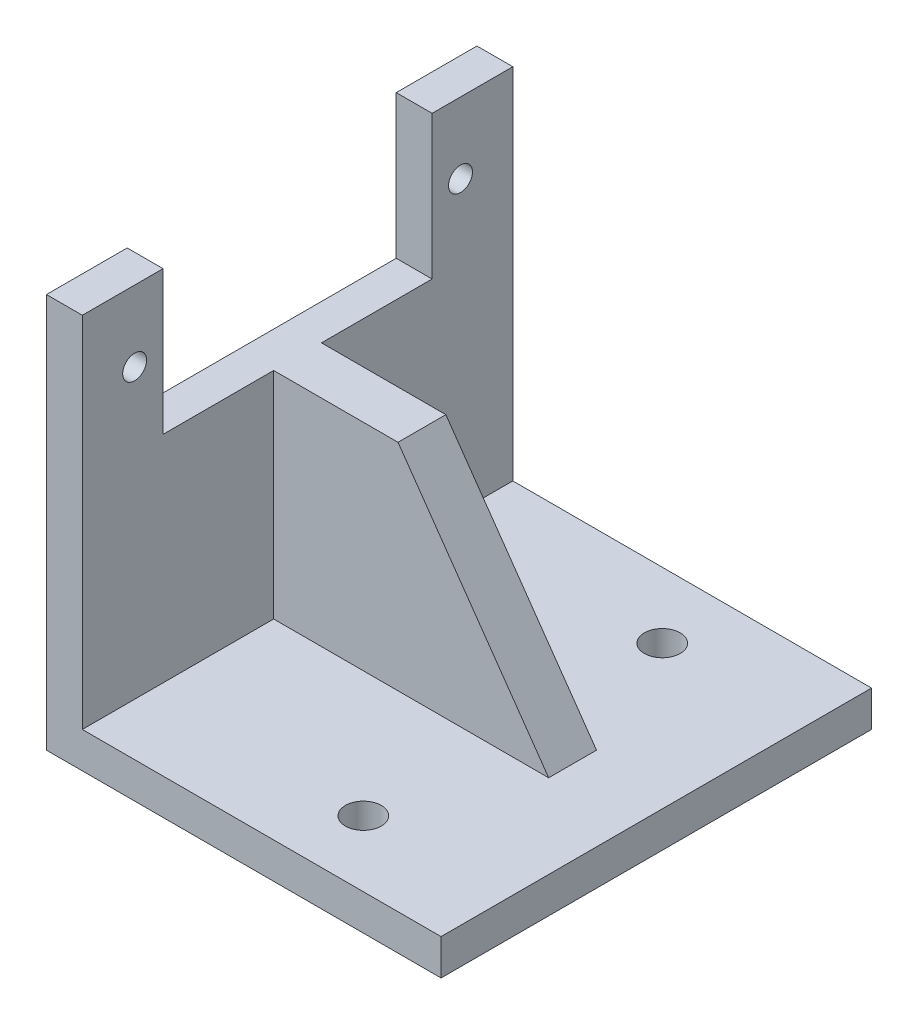
ISO-10303-21;
HEADER;
FILE_DESCRIPTION(('STEP AP214'),'2;1');
FILE_NAME('part.step','',(''),(''),'','','');
FILE_SCHEMA(('AUTOMOTIVE_DESIGN { 1 0 10303 214 1 1 1 1 }'));
ENDSEC;
DATA;
#1=APPLICATION_CONTEXT('core data for automotive mechanical design processes');
#2=APPLICATION_PROTOCOL_DEFINITION('international standard','automotive_design',2000,#1);
#3=PRODUCT_CONTEXT('',#1,'mechanical');
#4=PRODUCT('Part','Part','',(#3));
#5=PRODUCT_RELATED_PRODUCT_CATEGORY('part','',(#4));
#6=PRODUCT_DEFINITION_FORMATION('','',#4);
#7=PRODUCT_DEFINITION_CONTEXT('part definition',#1,'design');
#8=PRODUCT_DEFINITION('design','',#6,#7);
#9=PRODUCT_DEFINITION_SHAPE('','',#8);
#10=(LENGTH_UNIT() NAMED_UNIT(*) SI_UNIT(.MILLI.,.METRE.));
#11=(NAMED_UNIT(*) PLANE_ANGLE_UNIT() SI_UNIT($,.RADIAN.));
#12=(NAMED_UNIT(*) SI_UNIT($,.STERADIAN.) SOLID_ANGLE_UNIT());
#13=UNCERTAINTY_MEASURE_WITH_UNIT(LENGTH_MEASURE(1.E-05),#10,'distance_accuracy_value','');
#14=(GEOMETRIC_REPRESENTATION_CONTEXT(3) GLOBAL_UNCERTAINTY_ASSIGNED_CONTEXT((#13)) GLOBAL_UNIT_ASSIGNED_CONTEXT((#10,
#11,#12)) REPRESENTATION_CONTEXT('',''));
#15=CARTESIAN_POINT('',(0.,0.,0.));
#16=DIRECTION('',(0.,0.,1.));
#17=DIRECTION('',(1.,0.,0.));
#18=AXIS2_PLACEMENT_3D('',#15,#16,#17);
#19=CARTESIAN_POINT('',(0.,0.,18.));
#20=DIRECTION('',(0.,1.,0.));
#21=DIRECTION('',(0.,0.,1.));
#22=AXIS2_PLACEMENT_3D('',#19,#20,#21);
#23=PLANE('',#22);
#24=CARTESIAN_POINT('',(18.,0.,-12.5));
#25=DIRECTION('',(0.,1.,0.));
#26=DIRECTION('',(0.,0.,1.));
#27=AXIS2_PLACEMENT_3D('',#24,#25,#26);
#28=CIRCLE('',#27,1.5);
#29=CARTESIAN_POINT('',(18.,0.,-11.));
#30=VERTEX_POINT('',#29);
#31=EDGE_CURVE('E524',#30,#30,#28,.T.);
#32=ORIENTED_EDGE('',*,*,#31,.F.);
#33=EDGE_LOOP('',(#32));
#34=FACE_BOUND('',#33,.T.);
#35=CARTESIAN_POINT('',(18.,0.,12.5));
#36=DIRECTION('',(0.,1.,0.));
#37=DIRECTION('',(0.,0.,1.));
#38=AXIS2_PLACEMENT_3D('',#35,#36,#37);
#39=CIRCLE('',#38,1.5);
#40=CARTESIAN_POINT('',(18.,0.,14.));
#41=VERTEX_POINT('',#40);
#42=EDGE_CURVE('E532',#41,#41,#39,.T.);
#43=ORIENTED_EDGE('',*,*,#42,.F.);
#44=EDGE_LOOP('',(#43));
#45=FACE_BOUND('',#44,.T.);
#46=DIRECTION('',(0.,0.,-1.));
#47=VECTOR('',#46,1.);
#48=CARTESIAN_POINT('',(23.,0.,2.));
#49=LINE('',#48,#47);
#50=CARTESIAN_POINT('',(23.,0.,2.));
#51=VERTEX_POINT('',#50);
#52=CARTESIAN_POINT('',(23.,0.,-2.));
#53=VERTEX_POINT('',#52);
#54=EDGE_CURVE('E144',#51,#53,#49,.T.);
#55=ORIENTED_EDGE('',*,*,#54,.F.);
#56=DIRECTION('',(1.,0.,0.));
#57=VECTOR('',#56,1.);
#58=CARTESIAN_POINT('',(23.,0.,2.));
#59=LINE('',#58,#57);
#60=CARTESIAN_POINT('',(0.,0.,1.99999999999999));
#61=VERTEX_POINT('',#60);
#62=EDGE_CURVE('E171',#61,#51,#59,.T.);
#63=ORIENTED_EDGE('',*,*,#62,.F.);
#64=DIRECTION('',(0.,0.,-1.));
#65=VECTOR('',#64,1.);
#66=CARTESIAN_POINT('',(0.,0.,18.));
#67=LINE('',#66,#65);
#68=CARTESIAN_POINT('',(0.,0.,18.));
#69=VERTEX_POINT('',#68);
#70=EDGE_CURVE('E291',#69,#61,#67,.T.);
#71=ORIENTED_EDGE('',*,*,#70,.F.);
#72=DIRECTION('',(1.,0.,0.));
#73=VECTOR('',#72,1.);
#74=CARTESIAN_POINT('',(0.,0.,18.));
#75=LINE('',#74,#73);
#76=CARTESIAN_POINT('',(30.,0.,18.));
#77=VERTEX_POINT('',#76);
#78=EDGE_CURVE('E241',#69,#77,#75,.T.);
#79=ORIENTED_EDGE('',*,*,#78,.T.);
#80=DIRECTION('',(0.,0.,-1.));
#81=VECTOR('',#80,1.);
#82=CARTESIAN_POINT('',(30.,0.,18.));
#83=LINE('',#82,#81);
#84=CARTESIAN_POINT('',(30.,0.,-18.));
#85=VERTEX_POINT('',#84);
#86=EDGE_CURVE('E48',#77,#85,#83,.T.);
#87=ORIENTED_EDGE('',*,*,#86,.T.);
#88=DIRECTION('',(1.,0.,0.));
#89=VECTOR('',#88,1.);
#90=CARTESIAN_POINT('',(0.,0.,-18.));
#91=LINE('',#90,#89);
#92=CARTESIAN_POINT('',(0.,0.,-18.));
#93=VERTEX_POINT('',#92);
#94=EDGE_CURVE('E263',#93,#85,#91,.T.);
#95=ORIENTED_EDGE('',*,*,#94,.F.);
#96=CARTESIAN_POINT('',(0.,0.,-1.99999999999999));
#97=VERTEX_POINT('',#96);
#98=EDGE_CURVE('E290',#97,#93,#67,.T.);
#99=ORIENTED_EDGE('',*,*,#98,.F.);
#100=DIRECTION('',(-1.,0.,0.));
#101=VECTOR('',#100,1.);
#102=CARTESIAN_POINT('',(23.,0.,-2.));
#103=LINE('',#102,#101);
#104=EDGE_CURVE('E167',#53,#97,#103,.T.);
#105=ORIENTED_EDGE('',*,*,#104,.F.);
#106=EDGE_LOOP('',(#55,#63,#71,#79,#87,#95,#99,#105));
#107=FACE_BOUND('',#106,.T.);
#108=ADVANCED_FACE('F39',(#34,#45,#107),#23,.T.);
#109=CARTESIAN_POINT('',(0.,0.,18.));
#110=DIRECTION('',(1.,0.,0.));
#111=DIRECTION('',(0.,0.,-1.));
#112=AXIS2_PLACEMENT_3D('',#109,#110,#111);
#113=PLANE('',#112);
#114=CARTESIAN_POINT('',(0.,24.0694235305909,13.625));
#115=DIRECTION('',(1.,0.,0.));
#116=DIRECTION('',(0.,0.,-1.));
#117=AXIS2_PLACEMENT_3D('',#114,#115,#116);
#118=CIRCLE('',#117,1.);
#119=CARTESIAN_POINT('',(0.,24.0694235305909,12.625));
#120=VERTEX_POINT('',#119);
#121=EDGE_CURVE('E181',#120,#120,#118,.T.);
#122=ORIENTED_EDGE('',*,*,#121,.F.);
#123=EDGE_LOOP('',(#122));
#124=FACE_BOUND('',#123,.T.);
#125=ORIENTED_EDGE('',*,*,#70,.T.);
#126=DIRECTION('',(0.,-1.,0.));
#127=VECTOR('',#126,1.);
#128=CARTESIAN_POINT('',(0.,18.,1.99999999999999));
#129=LINE('',#128,#127);
#130=CARTESIAN_POINT('',(0.,18.,1.99999999999999));
#131=VERTEX_POINT('',#130);
#132=EDGE_CURVE('E165',#131,#61,#129,.T.);
#133=ORIENTED_EDGE('',*,*,#132,.F.);
#134=DIRECTION('',(0.,0.,-1.));
#135=VECTOR('',#134,1.);
#136=CARTESIAN_POINT('',(0.,18.,11.25));
#137=LINE('',#136,#135);
#138=CARTESIAN_POINT('',(0.,18.,11.25));
#139=VERTEX_POINT('',#138);
#140=EDGE_CURVE('E203',#139,#131,#137,.T.);
#141=ORIENTED_EDGE('',*,*,#140,.F.);
#142=DIRECTION('',(0.,-1.,0.));
#143=VECTOR('',#142,1.);
#144=CARTESIAN_POINT('',(0.,18.,11.25));
#145=LINE('',#144,#143);
#146=CARTESIAN_POINT('',(0.,30.,11.25));
#147=VERTEX_POINT('',#146);
#148=EDGE_CURVE('E212',#147,#139,#145,.T.);
#149=ORIENTED_EDGE('',*,*,#148,.F.);
#150=DIRECTION('',(0.,0.,-1.));
#151=VECTOR('',#150,1.);
#152=CARTESIAN_POINT('',(0.,30.,18.));
#153=LINE('',#152,#151);
#154=CARTESIAN_POINT('',(0.,30.,18.));
#155=VERTEX_POINT('',#154);
#156=EDGE_CURVE('E286',#155,#147,#153,.T.);
#157=ORIENTED_EDGE('',*,*,#156,.F.);
#158=DIRECTION('',(0.,-1.,0.));
#159=VECTOR('',#158,1.);
#160=CARTESIAN_POINT('',(0.,0.,18.));
#161=LINE('',#160,#159);
#162=EDGE_CURVE('E244',#155,#69,#161,.T.);
#163=ORIENTED_EDGE('',*,*,#162,.T.);
#164=EDGE_LOOP('',(#125,#133,#141,#149,#157,#163));
#165=FACE_BOUND('',#164,.T.);
#166=ADVANCED_FACE('F335',(#124,#165),#113,.T.);
#167=CARTESIAN_POINT('',(0.,24.0694235305909,-13.625));
#168=DIRECTION('',(1.,0.,0.));
#169=DIRECTION('',(0.,0.,-1.));
#170=AXIS2_PLACEMENT_3D('',#167,#168,#169);
#171=CIRCLE('',#170,1.);
#172=CARTESIAN_POINT('',(0.,24.0694235305909,-14.625));
#173=VERTEX_POINT('',#172);
#174=EDGE_CURVE('E187',#173,#173,#171,.T.);
#175=ORIENTED_EDGE('',*,*,#174,.F.);
#176=EDGE_LOOP('',(#175));
#177=FACE_BOUND('',#176,.T.);
#178=CARTESIAN_POINT('',(0.,18.,-1.99999999999999));
#179=VERTEX_POINT('',#178);
#180=CARTESIAN_POINT('',(0.,18.,-11.25));
#181=VERTEX_POINT('',#180);
#182=EDGE_CURVE('E216',#179,#181,#137,.T.);
#183=ORIENTED_EDGE('',*,*,#182,.F.);
#184=DIRECTION('',(0.,-1.,0.));
#185=VECTOR('',#184,1.);
#186=CARTESIAN_POINT('',(0.,18.,-1.99999999999999));
#187=LINE('',#186,#185);
#188=EDGE_CURVE('E159',#179,#97,#187,.T.);
#189=ORIENTED_EDGE('',*,*,#188,.T.);
#190=ORIENTED_EDGE('',*,*,#98,.T.);
#191=DIRECTION('',(0.,-1.,0.));
#192=VECTOR('',#191,1.);
#193=CARTESIAN_POINT('',(0.,0.,-18.));
#194=LINE('',#193,#192);
#195=CARTESIAN_POINT('',(0.,30.,-18.));
#196=VERTEX_POINT('',#195);
#197=EDGE_CURVE('E267',#196,#93,#194,.T.);
#198=ORIENTED_EDGE('',*,*,#197,.F.);
#199=CARTESIAN_POINT('',(0.,30.,-11.25));
#200=VERTEX_POINT('',#199);
#201=EDGE_CURVE('E285',#200,#196,#153,.T.);
#202=ORIENTED_EDGE('',*,*,#201,.F.);
#203=DIRECTION('',(0.,1.,0.));
#204=VECTOR('',#203,1.);
#205=CARTESIAN_POINT('',(0.,18.,-11.25));
#206=LINE('',#205,#204);
#207=EDGE_CURVE('E186',#181,#200,#206,.T.);
#208=ORIENTED_EDGE('',*,*,#207,.F.);
#209=EDGE_LOOP('',(#183,#189,#190,#198,#202,#208));
#210=FACE_BOUND('',#209,.T.);
#211=ADVANCED_FACE('F313',(#177,#210),#113,.T.);
#212=CARTESIAN_POINT('',(-3.,30.,18.));
#213=DIRECTION('',(0.,1.,0.));
#214=DIRECTION('',(0.,0.,1.));
#215=AXIS2_PLACEMENT_3D('',#212,#213,#214);
#216=PLANE('',#215);
#217=DIRECTION('',(1.,0.,0.));
#218=VECTOR('',#217,1.);
#219=CARTESIAN_POINT('',(-3.,30.,-11.25));
#220=LINE('',#219,#218);
#221=CARTESIAN_POINT('',(-3.,30.,-11.25));
#222=VERTEX_POINT('',#221);
#223=EDGE_CURVE('E209',#222,#200,#220,.T.);
#224=ORIENTED_EDGE('',*,*,#223,.T.);
#225=ORIENTED_EDGE('',*,*,#201,.T.);
#226=DIRECTION('',(1.,0.,0.));
#227=VECTOR('',#226,1.);
#228=CARTESIAN_POINT('',(-3.,30.,-18.));
#229=LINE('',#228,#227);
#230=CARTESIAN_POINT('',(-3.,30.,-18.));
#231=VERTEX_POINT('',#230);
#232=EDGE_CURVE('E271',#231,#196,#229,.T.);
#233=ORIENTED_EDGE('',*,*,#232,.F.);
#234=DIRECTION('',(0.,0.,-1.));
#235=VECTOR('',#234,1.);
#236=CARTESIAN_POINT('',(-3.,30.,18.));
#237=LINE('',#236,#235);
#238=EDGE_CURVE('E280',#222,#231,#237,.T.);
#239=ORIENTED_EDGE('',*,*,#238,.F.);
#240=EDGE_LOOP('',(#224,#225,#233,#239));
#241=FACE_BOUND('',#240,.T.);
#242=ADVANCED_FACE('F343',(#241),#216,.T.);
#243=CARTESIAN_POINT('',(0.,-3.,18.));
#244=DIRECTION('',(0.,1.,0.));
#245=DIRECTION('',(0.,0.,1.));
#246=AXIS2_PLACEMENT_3D('',#243,#244,#245);
#247=PLANE('',#246);
#248=CARTESIAN_POINT('',(18.,-3.,-12.5));
#249=DIRECTION('',(0.,1.,0.));
#250=DIRECTION('',(0.,0.,1.));
#251=AXIS2_PLACEMENT_3D('',#248,#249,#250);
#252=CIRCLE('',#251,1.5);
#253=CARTESIAN_POINT('',(18.,-3.,-11.));
#254=VERTEX_POINT('',#253);
#255=EDGE_CURVE('E148',#254,#254,#252,.T.);
#256=ORIENTED_EDGE('',*,*,#255,.T.);
#257=EDGE_LOOP('',(#256));
#258=FACE_BOUND('',#257,.T.);
#259=CARTESIAN_POINT('',(18.,-3.,12.5));
#260=DIRECTION('',(0.,1.,0.));
#261=DIRECTION('',(0.,0.,1.));
#262=AXIS2_PLACEMENT_3D('',#259,#260,#261);
#263=CIRCLE('',#262,1.5);
#264=CARTESIAN_POINT('',(18.,-3.,14.));
#265=VERTEX_POINT('',#264);
#266=EDGE_CURVE('E526',#265,#265,#263,.T.);
#267=ORIENTED_EDGE('',*,*,#266,.T.);
#268=EDGE_LOOP('',(#267));
#269=FACE_BOUND('',#268,.T.);
#270=DIRECTION('',(1.,0.,0.));
#271=VECTOR('',#270,1.);
#272=CARTESIAN_POINT('',(0.,-3.,-18.));
#273=LINE('',#272,#271);
#274=CARTESIAN_POINT('',(-3.,-3.,-18.));
#275=VERTEX_POINT('',#274);
#276=CARTESIAN_POINT('',(30.,-3.,-18.));
#277=VERTEX_POINT('',#276);
#278=EDGE_CURVE('E223',#275,#277,#273,.T.);
#279=ORIENTED_EDGE('',*,*,#278,.T.);
#280=DIRECTION('',(0.,0.,-1.));
#281=VECTOR('',#280,1.);
#282=CARTESIAN_POINT('',(30.,-3.,18.));
#283=LINE('',#282,#281);
#284=CARTESIAN_POINT('',(30.,-3.,18.));
#285=VERTEX_POINT('',#284);
#286=EDGE_CURVE('E11',#285,#277,#283,.T.);
#287=ORIENTED_EDGE('',*,*,#286,.F.);
#288=DIRECTION('',(1.,0.,0.));
#289=VECTOR('',#288,1.);
#290=CARTESIAN_POINT('',(0.,-3.,18.));
#291=LINE('',#290,#289);
#292=CARTESIAN_POINT('',(-3.,-3.,18.));
#293=VERTEX_POINT('',#292);
#294=EDGE_CURVE('E233',#293,#285,#291,.T.);
#295=ORIENTED_EDGE('',*,*,#294,.F.);
#296=DIRECTION('',(0.,0.,-1.));
#297=VECTOR('',#296,1.);
#298=CARTESIAN_POINT('',(-3.,-3.,18.));
#299=LINE('',#298,#297);
#300=EDGE_CURVE('E255',#293,#275,#299,.T.);
#301=ORIENTED_EDGE('',*,*,#300,.T.);
#302=EDGE_LOOP('',(#279,#287,#295,#301));
#303=FACE_BOUND('',#302,.T.);
#304=ADVANCED_FACE('F41',(#258,#269,#303),#247,.F.);
#305=CARTESIAN_POINT('',(30.,0.,18.));
#306=DIRECTION('',(1.,0.,0.));
#307=DIRECTION('',(0.,0.,-1.));
#308=AXIS2_PLACEMENT_3D('',#305,#306,#307);
#309=PLANE('',#308);
#310=DIRECTION('',(0.,-1.,0.));
#311=VECTOR('',#310,1.);
#312=CARTESIAN_POINT('',(30.,0.,-18.));
#313=LINE('',#312,#311);
#314=EDGE_CURVE('E259',#85,#277,#313,.T.);
#315=ORIENTED_EDGE('',*,*,#314,.F.);
#316=ORIENTED_EDGE('',*,*,#86,.F.);
#317=DIRECTION('',(0.,-1.,0.));
#318=VECTOR('',#317,1.);
#319=CARTESIAN_POINT('',(30.,0.,18.));
#320=LINE('',#319,#318);
#321=EDGE_CURVE('E236',#77,#285,#320,.T.);
#322=ORIENTED_EDGE('',*,*,#321,.T.);
#323=ORIENTED_EDGE('',*,*,#286,.T.);
#324=EDGE_LOOP('',(#315,#316,#322,#323));
#325=FACE_BOUND('',#324,.T.);
#326=ADVANCED_FACE('F303',(#325),#309,.T.);
#327=DIRECTION('',(1.,0.,0.));
#328=VECTOR('',#327,1.);
#329=CARTESIAN_POINT('',(-3.,30.,11.25));
#330=LINE('',#329,#328);
#331=CARTESIAN_POINT('',(-3.,30.,11.25));
#332=VERTEX_POINT('',#331);
#333=EDGE_CURVE('E227',#332,#147,#330,.T.);
#334=ORIENTED_EDGE('',*,*,#333,.F.);
#335=CARTESIAN_POINT('',(-3.,30.,18.));
#336=VERTEX_POINT('',#335);
#337=EDGE_CURVE('E281',#336,#332,#237,.T.);
#338=ORIENTED_EDGE('',*,*,#337,.F.);
#339=DIRECTION('',(1.,0.,0.));
#340=VECTOR('',#339,1.);
#341=CARTESIAN_POINT('',(-3.,30.,18.));
#342=LINE('',#341,#340);
#343=EDGE_CURVE('E248',#336,#155,#342,.T.);
#344=ORIENTED_EDGE('',*,*,#343,.T.);
#345=ORIENTED_EDGE('',*,*,#156,.T.);
#346=EDGE_LOOP('',(#334,#338,#344,#345));
#347=FACE_BOUND('',#346,.T.);
#348=ADVANCED_FACE('F331',(#347),#216,.T.);
#349=CARTESIAN_POINT('',(-3.,0.,18.));
#350=DIRECTION('',(1.,0.,0.));
#351=DIRECTION('',(0.,0.,-1.));
#352=AXIS2_PLACEMENT_3D('',#349,#350,#351);
#353=PLANE('',#352);
#354=CARTESIAN_POINT('',(-3.,24.0694235305909,-13.625));
#355=DIRECTION('',(1.,0.,0.));
#356=DIRECTION('',(0.,0.,-1.));
#357=AXIS2_PLACEMENT_3D('',#354,#355,#356);
#358=CIRCLE('',#357,1.);
#359=CARTESIAN_POINT('',(-3.,24.0694235305909,-14.625));
#360=VERTEX_POINT('',#359);
#361=EDGE_CURVE('E182',#360,#360,#358,.T.);
#362=ORIENTED_EDGE('',*,*,#361,.T.);
#363=EDGE_LOOP('',(#362));
#364=FACE_BOUND('',#363,.T.);
#365=CARTESIAN_POINT('',(-3.,24.0694235305909,13.625));
#366=DIRECTION('',(1.,0.,0.));
#367=DIRECTION('',(0.,0.,-1.));
#368=AXIS2_PLACEMENT_3D('',#365,#366,#367);
#369=CIRCLE('',#368,1.);
#370=CARTESIAN_POINT('',(-3.,24.0694235305909,12.625));
#371=VERTEX_POINT('',#370);
#372=EDGE_CURVE('E191',#371,#371,#369,.T.);
#373=ORIENTED_EDGE('',*,*,#372,.T.);
#374=EDGE_LOOP('',(#373));
#375=FACE_BOUND('',#374,.T.);
#376=DIRECTION('',(0.,0.,-1.));
#377=VECTOR('',#376,1.);
#378=CARTESIAN_POINT('',(-3.,18.,11.25));
#379=LINE('',#378,#377);
#380=CARTESIAN_POINT('',(-3.,18.,11.25));
#381=VERTEX_POINT('',#380);
#382=CARTESIAN_POINT('',(-3.,18.,-11.25));
#383=VERTEX_POINT('',#382);
#384=EDGE_CURVE('E62',#381,#383,#379,.T.);
#385=ORIENTED_EDGE('',*,*,#384,.T.);
#386=DIRECTION('',(0.,1.,0.));
#387=VECTOR('',#386,1.);
#388=CARTESIAN_POINT('',(-3.,18.,-11.25));
#389=LINE('',#388,#387);
#390=EDGE_CURVE('E198',#383,#222,#389,.T.);
#391=ORIENTED_EDGE('',*,*,#390,.T.);
#392=ORIENTED_EDGE('',*,*,#238,.T.);
#393=DIRECTION('',(0.,1.,0.));
#394=VECTOR('',#393,1.);
#395=CARTESIAN_POINT('',(-3.,0.,-18.));
#396=LINE('',#395,#394);
#397=EDGE_CURVE('E237',#231,#275,#396,.F.);
#398=ORIENTED_EDGE('',*,*,#397,.T.);
#399=ORIENTED_EDGE('',*,*,#300,.F.);
#400=DIRECTION('',(0.,1.,0.));
#401=VECTOR('',#400,1.);
#402=CARTESIAN_POINT('',(-3.,0.,18.));
#403=LINE('',#402,#401);
#404=EDGE_CURVE('E252',#336,#293,#403,.F.);
#405=ORIENTED_EDGE('',*,*,#404,.F.);
#406=ORIENTED_EDGE('',*,*,#337,.T.);
#407=DIRECTION('',(0.,-1.,0.));
#408=VECTOR('',#407,1.);
#409=CARTESIAN_POINT('',(-3.,18.,11.25));
#410=LINE('',#409,#408);
#411=EDGE_CURVE('E202',#332,#381,#410,.T.);
#412=ORIENTED_EDGE('',*,*,#411,.T.);
#413=EDGE_LOOP('',(#385,#391,#392,#398,#399,#405,#406,#412));
#414=FACE_BOUND('',#413,.T.);
#415=ADVANCED_FACE('F324',(#364,#375,#414),#353,.F.);
#416=CARTESIAN_POINT('',(0.,0.,18.));
#417=DIRECTION('',(0.,0.,-1.));
#418=DIRECTION('',(-1.,0.,0.));
#419=AXIS2_PLACEMENT_3D('',#416,#417,#418);
#420=PLANE('',#419);
#421=ORIENTED_EDGE('',*,*,#294,.T.);
#422=ORIENTED_EDGE('',*,*,#321,.F.);
#423=ORIENTED_EDGE('',*,*,#78,.F.);
#424=ORIENTED_EDGE('',*,*,#162,.F.);
#425=ORIENTED_EDGE('',*,*,#343,.F.);
#426=ORIENTED_EDGE('',*,*,#404,.T.);
#427=EDGE_LOOP('',(#421,#422,#423,#424,#425,#426));
#428=FACE_BOUND('',#427,.T.);
#429=ADVANCED_FACE('F338',(#428),#420,.F.);
#430=CARTESIAN_POINT('',(0.,0.,-18.));
#431=DIRECTION('',(0.,0.,-1.));
#432=DIRECTION('',(-1.,0.,0.));
#433=AXIS2_PLACEMENT_3D('',#430,#431,#432);
#434=PLANE('',#433);
#435=ORIENTED_EDGE('',*,*,#278,.F.);
#436=ORIENTED_EDGE('',*,*,#397,.F.);
#437=ORIENTED_EDGE('',*,*,#232,.T.);
#438=ORIENTED_EDGE('',*,*,#197,.T.);
#439=ORIENTED_EDGE('',*,*,#94,.T.);
#440=ORIENTED_EDGE('',*,*,#314,.T.);
#441=EDGE_LOOP('',(#435,#436,#437,#438,#439,#440));
#442=FACE_BOUND('',#441,.T.);
#443=ADVANCED_FACE('F307',(#442),#434,.T.);
#444=CARTESIAN_POINT('',(-3.,18.,-11.25));
#445=DIRECTION('',(0.,0.,-1.));
#446=DIRECTION('',(-1.,0.,0.));
#447=AXIS2_PLACEMENT_3D('',#444,#445,#446);
#448=PLANE('',#447);
#449=ORIENTED_EDGE('',*,*,#207,.T.);
#450=ORIENTED_EDGE('',*,*,#223,.F.);
#451=ORIENTED_EDGE('',*,*,#390,.F.);
#452=DIRECTION('',(1.,0.,0.));
#453=VECTOR('',#452,1.);
#454=CARTESIAN_POINT('',(-3.,18.,-11.25));
#455=LINE('',#454,#453);
#456=EDGE_CURVE('E219',#383,#181,#455,.T.);
#457=ORIENTED_EDGE('',*,*,#456,.T.);
#458=EDGE_LOOP('',(#449,#450,#451,#457));
#459=FACE_BOUND('',#458,.T.);
#460=ADVANCED_FACE('F321',(#459),#448,.F.);
#461=CARTESIAN_POINT('',(-3.,18.,11.25));
#462=DIRECTION('',(0.,-1.,0.));
#463=DIRECTION('',(0.,0.,-1.));
#464=AXIS2_PLACEMENT_3D('',#461,#462,#463);
#465=PLANE('',#464);
#466=DIRECTION('',(1.,0.,0.));
#467=VECTOR('',#466,1.);
#468=CARTESIAN_POINT('',(23.,18.,2.));
#469=LINE('',#468,#467);
#470=CARTESIAN_POINT('',(10.3995943514974,18.,2.));
#471=VERTEX_POINT('',#470);
#472=EDGE_CURVE('E153',#131,#471,#469,.T.);
#473=ORIENTED_EDGE('',*,*,#472,.T.);
#474=DIRECTION('',(0.,0.,-1.));
#475=VECTOR('',#474,1.);
#476=CARTESIAN_POINT('',(10.3995943514974,18.,18.));
#477=LINE('',#476,#475);
#478=CARTESIAN_POINT('',(10.3995943514974,18.,-2.));
#479=VERTEX_POINT('',#478);
#480=EDGE_CURVE('E141',#471,#479,#477,.T.);
#481=ORIENTED_EDGE('',*,*,#480,.T.);
#482=DIRECTION('',(-1.,0.,0.));
#483=VECTOR('',#482,1.);
#484=CARTESIAN_POINT('',(23.,18.,-2.));
#485=LINE('',#484,#483);
#486=EDGE_CURVE('E55',#479,#179,#485,.T.);
#487=ORIENTED_EDGE('',*,*,#486,.T.);
#488=ORIENTED_EDGE('',*,*,#182,.T.);
#489=ORIENTED_EDGE('',*,*,#456,.F.);
#490=ORIENTED_EDGE('',*,*,#384,.F.);
#491=DIRECTION('',(1.,0.,0.));
#492=VECTOR('',#491,1.);
#493=CARTESIAN_POINT('',(-3.,18.,11.25));
#494=LINE('',#493,#492);
#495=EDGE_CURVE('E224',#381,#139,#494,.T.);
#496=ORIENTED_EDGE('',*,*,#495,.T.);
#497=ORIENTED_EDGE('',*,*,#140,.T.);
#498=EDGE_LOOP('',(#473,#481,#487,#488,#489,#490,#496,#497));
#499=FACE_BOUND('',#498,.T.);
#500=ADVANCED_FACE('F151',(#499),#465,.F.);
#501=CARTESIAN_POINT('',(-3.,18.,11.25));
#502=DIRECTION('',(0.,0.,1.));
#503=DIRECTION('',(1.,0.,0.));
#504=AXIS2_PLACEMENT_3D('',#501,#502,#503);
#505=PLANE('',#504);
#506=ORIENTED_EDGE('',*,*,#148,.T.);
#507=ORIENTED_EDGE('',*,*,#495,.F.);
#508=ORIENTED_EDGE('',*,*,#411,.F.);
#509=ORIENTED_EDGE('',*,*,#333,.T.);
#510=EDGE_LOOP('',(#506,#507,#508,#509));
#511=FACE_BOUND('',#510,.T.);
#512=ADVANCED_FACE('F328',(#511),#505,.F.);
#513=CARTESIAN_POINT('',(-3.,24.0694235305909,13.625));
#514=DIRECTION('',(1.,0.,0.));
#515=DIRECTION('',(0.,0.,-1.));
#516=AXIS2_PLACEMENT_3D('',#513,#514,#515);
#517=CYLINDRICAL_SURFACE('',#516,1.);
#518=ORIENTED_EDGE('',*,*,#372,.F.);
#519=EDGE_LOOP('',(#518));
#520=FACE_BOUND('',#519,.T.);
#521=ORIENTED_EDGE('',*,*,#121,.T.);
#522=EDGE_LOOP('',(#521));
#523=FACE_BOUND('',#522,.T.);
#524=ADVANCED_FACE('F412',(#520,#523),#517,.F.);
#525=CARTESIAN_POINT('',(-3.,24.0694235305909,-13.625));
#526=DIRECTION('',(1.,0.,0.));
#527=DIRECTION('',(0.,0.,-1.));
#528=AXIS2_PLACEMENT_3D('',#525,#526,#527);
#529=CYLINDRICAL_SURFACE('',#528,1.);
#530=ORIENTED_EDGE('',*,*,#361,.F.);
#531=EDGE_LOOP('',(#530));
#532=FACE_BOUND('',#531,.T.);
#533=ORIENTED_EDGE('',*,*,#174,.T.);
#534=EDGE_LOOP('',(#533));
#535=FACE_BOUND('',#534,.T.);
#536=ADVANCED_FACE('F418',(#532,#535),#529,.F.);
#537=CARTESIAN_POINT('',(23.,18.,2.));
#538=DIRECTION('',(0.,0.,-1.));
#539=DIRECTION('',(-1.,0.,0.));
#540=AXIS2_PLACEMENT_3D('',#537,#538,#539);
#541=PLANE('',#540);
#542=ORIENTED_EDGE('',*,*,#62,.T.);
#543=DIRECTION('',(-0.573474734927246,0.819223246984682,0.));
#544=VECTOR('',#543,1.);
#545=CARTESIAN_POINT('',(14.543530980606,12.0802811112023,2.));
#546=LINE('',#545,#544);
#547=EDGE_CURVE('E155',#51,#471,#546,.T.);
#548=ORIENTED_EDGE('',*,*,#547,.T.);
#549=ORIENTED_EDGE('',*,*,#472,.F.);
#550=ORIENTED_EDGE('',*,*,#132,.T.);
#551=EDGE_LOOP('',(#542,#548,#549,#550));
#552=FACE_BOUND('',#551,.T.);
#553=ADVANCED_FACE('F426',(#552),#541,.F.);
#554=CARTESIAN_POINT('',(23.,18.,-2.));
#555=DIRECTION('',(0.,0.,1.));
#556=DIRECTION('',(1.,0.,0.));
#557=AXIS2_PLACEMENT_3D('',#554,#555,#556);
#558=PLANE('',#557);
#559=ORIENTED_EDGE('',*,*,#486,.F.);
#560=DIRECTION('',(-0.573474734927246,0.819223246984682,0.));
#561=VECTOR('',#560,1.);
#562=CARTESIAN_POINT('',(23.,0.,-2.));
#563=LINE('',#562,#561);
#564=EDGE_CURVE('E139',#53,#479,#563,.T.);
#565=ORIENTED_EDGE('',*,*,#564,.F.);
#566=ORIENTED_EDGE('',*,*,#104,.T.);
#567=ORIENTED_EDGE('',*,*,#188,.F.);
#568=EDGE_LOOP('',(#559,#565,#566,#567));
#569=FACE_BOUND('',#568,.T.);
#570=ADVANCED_FACE('F157',(#569),#558,.F.);
#571=CARTESIAN_POINT('',(23.,0.,18.));
#572=DIRECTION('',(-0.819223246984682,-0.573474734927246,0.));
#573=DIRECTION('',(0.573474734927246,-0.819223246984682,0.));
#574=AXIS2_PLACEMENT_3D('',#571,#572,#573);
#575=PLANE('',#574);
#576=ORIENTED_EDGE('',*,*,#54,.T.);
#577=ORIENTED_EDGE('',*,*,#564,.T.);
#578=ORIENTED_EDGE('',*,*,#480,.F.);
#579=ORIENTED_EDGE('',*,*,#547,.F.);
#580=EDGE_LOOP('',(#576,#577,#578,#579));
#581=FACE_BOUND('',#580,.T.);
#582=ADVANCED_FACE('F140',(#581),#575,.F.);
#583=CARTESIAN_POINT('',(18.,-3.,12.5));
#584=DIRECTION('',(0.,1.,0.));
#585=DIRECTION('',(0.,0.,1.));
#586=AXIS2_PLACEMENT_3D('',#583,#584,#585);
#587=CYLINDRICAL_SURFACE('',#586,1.5);
#588=ORIENTED_EDGE('',*,*,#266,.F.);
#589=EDGE_LOOP('',(#588));
#590=FACE_BOUND('',#589,.T.);
#591=ORIENTED_EDGE('',*,*,#42,.T.);
#592=EDGE_LOOP('',(#591));
#593=FACE_BOUND('',#592,.T.);
#594=ADVANCED_FACE('F447',(#590,#593),#587,.F.);
#595=CARTESIAN_POINT('',(18.,-3.,-12.5));
#596=DIRECTION('',(0.,1.,0.));
#597=DIRECTION('',(0.,0.,1.));
#598=AXIS2_PLACEMENT_3D('',#595,#596,#597);
#599=CYLINDRICAL_SURFACE('',#598,1.5);
#600=ORIENTED_EDGE('',*,*,#255,.F.);
#601=EDGE_LOOP('',(#600));
#602=FACE_BOUND('',#601,.T.);
#603=ORIENTED_EDGE('',*,*,#31,.T.);
#604=EDGE_LOOP('',(#603));
#605=FACE_BOUND('',#604,.T.);
#606=ADVANCED_FACE('F454',(#602,#605),#599,.F.);
#607=CLOSED_SHELL('',(#108,#166,#211,#242,#304,#326,#348,#415,#429,#443,#460,#500,#512,#524,
#536,#553,#570,#582,#594,#606));
#608=MANIFOLD_SOLID_BREP('B2',#607);
#609=ADVANCED_BREP_SHAPE_REPRESENTATION('',(#18,#608),#14);
#610=SHAPE_DEFINITION_REPRESENTATION(#9,#609);
ENDSEC;
END-ISO-10303-21;
